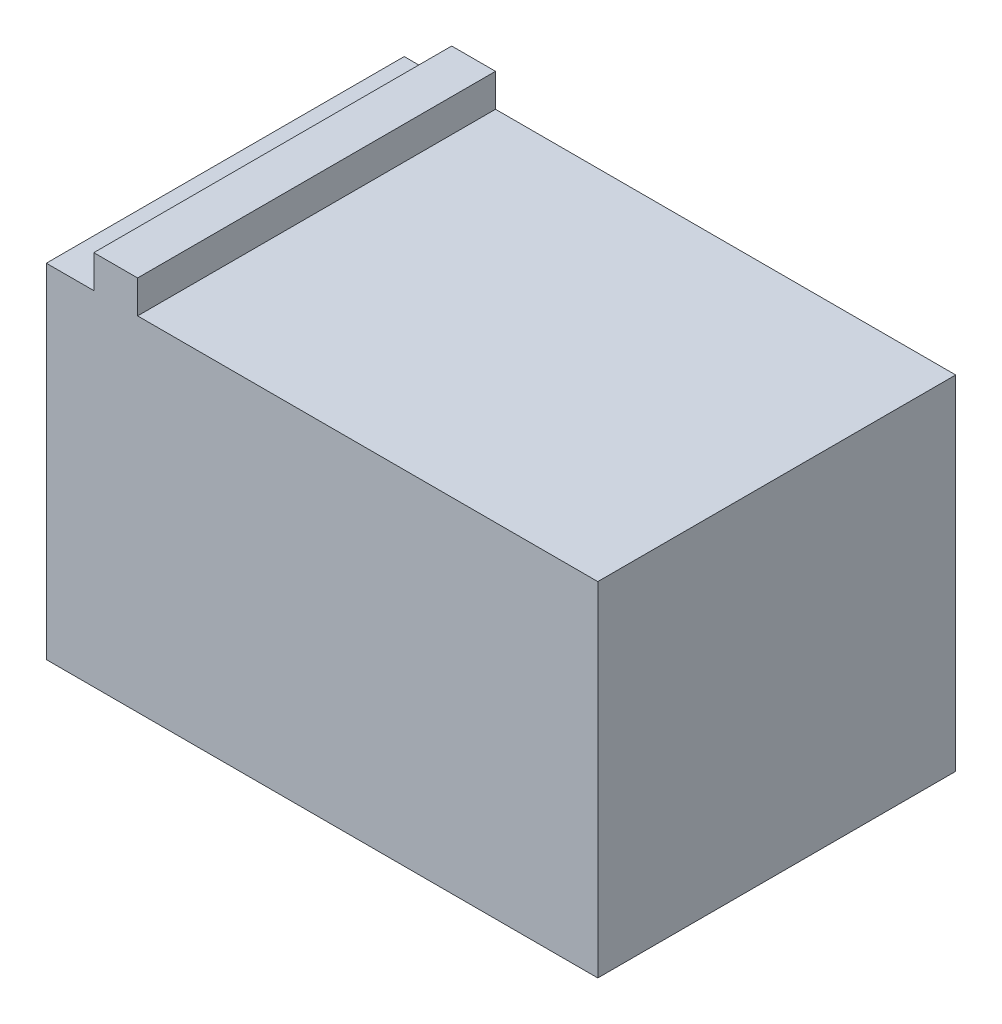
ISO-10303-21;
HEADER;
FILE_DESCRIPTION(('STEP AP214'),'2;1');
FILE_NAME('part.step','',(''),(''),'','','');
FILE_SCHEMA(('AUTOMOTIVE_DESIGN { 1 0 10303 214 1 1 1 1 }'));
ENDSEC;
DATA;
#1=APPLICATION_CONTEXT('core data for automotive mechanical design processes');
#2=APPLICATION_PROTOCOL_DEFINITION('international standard','automotive_design',2000,#1);
#3=PRODUCT_CONTEXT('',#1,'mechanical');
#4=PRODUCT('Part','Part','',(#3));
#5=PRODUCT_RELATED_PRODUCT_CATEGORY('part','',(#4));
#6=PRODUCT_DEFINITION_FORMATION('','',#4);
#7=PRODUCT_DEFINITION_CONTEXT('part definition',#1,'design');
#8=PRODUCT_DEFINITION('design','',#6,#7);
#9=PRODUCT_DEFINITION_SHAPE('','',#8);
#10=(LENGTH_UNIT() NAMED_UNIT(*) SI_UNIT(.MILLI.,.METRE.));
#11=(NAMED_UNIT(*) PLANE_ANGLE_UNIT() SI_UNIT($,.RADIAN.));
#12=(NAMED_UNIT(*) SI_UNIT($,.STERADIAN.) SOLID_ANGLE_UNIT());
#13=UNCERTAINTY_MEASURE_WITH_UNIT(LENGTH_MEASURE(1.E-05),#10,'distance_accuracy_value','');
#14=(GEOMETRIC_REPRESENTATION_CONTEXT(3) GLOBAL_UNCERTAINTY_ASSIGNED_CONTEXT((#13)) GLOBAL_UNIT_ASSIGNED_CONTEXT((#10,
#11,#12)) REPRESENTATION_CONTEXT('',''));
#15=CARTESIAN_POINT('',(0.,0.,0.));
#16=DIRECTION('',(0.,0.,1.));
#17=DIRECTION('',(1.,0.,0.));
#18=AXIS2_PLACEMENT_3D('',#15,#16,#17);
#19=CARTESIAN_POINT('',(0.,94.,0.));
#20=DIRECTION('',(0.,-1.,0.));
#21=DIRECTION('',(0.,0.,-1.));
#22=AXIS2_PLACEMENT_3D('',#19,#20,#21);
#23=PLANE('',#22);
#24=DIRECTION('',(0.,0.,1.));
#25=VECTOR('',#24,1.);
#26=CARTESIAN_POINT('',(-62.5,94.,-49.));
#27=LINE('',#26,#25);
#28=CARTESIAN_POINT('',(-62.5,94.,-49.));
#29=VERTEX_POINT('',#28);
#30=CARTESIAN_POINT('',(-62.5,94.,49.));
#31=VERTEX_POINT('',#30);
#32=EDGE_CURVE('E128',#29,#31,#27,.T.);
#33=ORIENTED_EDGE('',*,*,#32,.F.);
#34=DIRECTION('',(-1.,0.,0.));
#35=VECTOR('',#34,1.);
#36=CARTESIAN_POINT('',(-75.5,94.,-49.));
#37=LINE('',#36,#35);
#38=CARTESIAN_POINT('',(-75.5,94.,-49.));
#39=VERTEX_POINT('',#38);
#40=EDGE_CURVE('E145',#29,#39,#37,.T.);
#41=ORIENTED_EDGE('',*,*,#40,.T.);
#42=DIRECTION('',(0.,0.,1.));
#43=VECTOR('',#42,1.);
#44=CARTESIAN_POINT('',(-75.5,94.,49.));
#45=LINE('',#44,#43);
#46=CARTESIAN_POINT('',(-75.5,94.,49.));
#47=VERTEX_POINT('',#46);
#48=EDGE_CURVE('E150',#39,#47,#45,.T.);
#49=ORIENTED_EDGE('',*,*,#48,.T.);
#50=DIRECTION('',(1.,0.,0.));
#51=VECTOR('',#50,1.);
#52=CARTESIAN_POINT('',(-75.5,94.,49.));
#53=LINE('',#52,#51);
#54=EDGE_CURVE('E63',#47,#31,#53,.T.);
#55=ORIENTED_EDGE('',*,*,#54,.T.);
#56=EDGE_LOOP('',(#33,#41,#49,#55));
#57=FACE_BOUND('',#56,.T.);
#58=ADVANCED_FACE('F39',(#57),#23,.F.);
#59=DIRECTION('',(0.,0.,-1.));
#60=VECTOR('',#59,1.);
#61=CARTESIAN_POINT('',(-50.5,94.,-49.));
#62=LINE('',#61,#60);
#63=CARTESIAN_POINT('',(-50.5,94.,49.));
#64=VERTEX_POINT('',#63);
#65=CARTESIAN_POINT('',(-50.5,94.,-49.));
#66=VERTEX_POINT('',#65);
#67=EDGE_CURVE('E55',#64,#66,#62,.T.);
#68=ORIENTED_EDGE('',*,*,#67,.F.);
#69=CARTESIAN_POINT('',(75.5,94.,49.));
#70=VERTEX_POINT('',#69);
#71=EDGE_CURVE('E153',#64,#70,#53,.T.);
#72=ORIENTED_EDGE('',*,*,#71,.T.);
#73=DIRECTION('',(0.,0.,-1.));
#74=VECTOR('',#73,1.);
#75=CARTESIAN_POINT('',(75.5,94.,49.));
#76=LINE('',#75,#74);
#77=CARTESIAN_POINT('',(75.5,94.,-49.));
#78=VERTEX_POINT('',#77);
#79=EDGE_CURVE('E141',#70,#78,#76,.T.);
#80=ORIENTED_EDGE('',*,*,#79,.T.);
#81=EDGE_CURVE('E147',#78,#66,#37,.T.);
#82=ORIENTED_EDGE('',*,*,#81,.T.);
#83=EDGE_LOOP('',(#68,#72,#80,#82));
#84=FACE_BOUND('',#83,.T.);
#85=ADVANCED_FACE('F188',(#84),#23,.F.);
#86=CARTESIAN_POINT('',(75.5,94.,49.));
#87=DIRECTION('',(-1.,0.,0.));
#88=DIRECTION('',(0.,0.,1.));
#89=AXIS2_PLACEMENT_3D('',#86,#87,#88);
#90=PLANE('',#89);
#91=DIRECTION('',(0.,0.,-1.));
#92=VECTOR('',#91,1.);
#93=CARTESIAN_POINT('',(75.5,0.,49.));
#94=LINE('',#93,#92);
#95=CARTESIAN_POINT('',(75.5,0.,49.));
#96=VERTEX_POINT('',#95);
#97=CARTESIAN_POINT('',(75.5,0.,-49.));
#98=VERTEX_POINT('',#97);
#99=EDGE_CURVE('E130',#96,#98,#94,.T.);
#100=ORIENTED_EDGE('',*,*,#99,.T.);
#101=DIRECTION('',(0.,-1.,0.));
#102=VECTOR('',#101,1.);
#103=CARTESIAN_POINT('',(75.5,94.,-49.));
#104=LINE('',#103,#102);
#105=EDGE_CURVE('E11',#78,#98,#104,.T.);
#106=ORIENTED_EDGE('',*,*,#105,.F.);
#107=ORIENTED_EDGE('',*,*,#79,.F.);
#108=DIRECTION('',(0.,-1.,0.));
#109=VECTOR('',#108,1.);
#110=CARTESIAN_POINT('',(75.5,94.,49.));
#111=LINE('',#110,#109);
#112=EDGE_CURVE('E155',#70,#96,#111,.T.);
#113=ORIENTED_EDGE('',*,*,#112,.T.);
#114=EDGE_LOOP('',(#100,#106,#107,#113));
#115=FACE_BOUND('',#114,.T.);
#116=ADVANCED_FACE('F41',(#115),#90,.F.);
#117=CARTESIAN_POINT('',(-75.5,94.,-49.));
#118=DIRECTION('',(0.,0.,1.));
#119=DIRECTION('',(1.,0.,0.));
#120=AXIS2_PLACEMENT_3D('',#117,#118,#119);
#121=PLANE('',#120);
#122=DIRECTION('',(-1.,0.,0.));
#123=VECTOR('',#122,1.);
#124=CARTESIAN_POINT('',(-75.5,0.,-49.));
#125=LINE('',#124,#123);
#126=CARTESIAN_POINT('',(-75.5,0.,-49.));
#127=VERTEX_POINT('',#126);
#128=EDGE_CURVE('E135',#98,#127,#125,.T.);
#129=ORIENTED_EDGE('',*,*,#128,.T.);
#130=DIRECTION('',(0.,-1.,0.));
#131=VECTOR('',#130,1.);
#132=CARTESIAN_POINT('',(-75.5,94.,-49.));
#133=LINE('',#132,#131);
#134=EDGE_CURVE('E48',#39,#127,#133,.T.);
#135=ORIENTED_EDGE('',*,*,#134,.F.);
#136=ORIENTED_EDGE('',*,*,#40,.F.);
#137=DIRECTION('',(0.,-1.,0.));
#138=VECTOR('',#137,1.);
#139=CARTESIAN_POINT('',(-62.5,103.,-49.));
#140=LINE('',#139,#138);
#141=CARTESIAN_POINT('',(-62.5,103.,-49.));
#142=VERTEX_POINT('',#141);
#143=EDGE_CURVE('E192',#142,#29,#140,.T.);
#144=ORIENTED_EDGE('',*,*,#143,.F.);
#145=DIRECTION('',(-1.,0.,0.));
#146=VECTOR('',#145,1.);
#147=CARTESIAN_POINT('',(-62.5,103.,-49.));
#148=LINE('',#147,#146);
#149=CARTESIAN_POINT('',(-50.5,103.,-49.));
#150=VERTEX_POINT('',#149);
#151=EDGE_CURVE('E121',#150,#142,#148,.T.);
#152=ORIENTED_EDGE('',*,*,#151,.F.);
#153=DIRECTION('',(0.,-1.,0.));
#154=VECTOR('',#153,1.);
#155=CARTESIAN_POINT('',(-50.5,103.,-49.));
#156=LINE('',#155,#154);
#157=EDGE_CURVE('E137',#150,#66,#156,.T.);
#158=ORIENTED_EDGE('',*,*,#157,.T.);
#159=ORIENTED_EDGE('',*,*,#81,.F.);
#160=ORIENTED_EDGE('',*,*,#105,.T.);
#161=EDGE_LOOP('',(#129,#135,#136,#144,#152,#158,#159,#160));
#162=FACE_BOUND('',#161,.T.);
#163=ADVANCED_FACE('F191',(#162),#121,.F.);
#164=CARTESIAN_POINT('',(-75.5,94.,49.));
#165=DIRECTION('',(1.,0.,0.));
#166=DIRECTION('',(0.,0.,-1.));
#167=AXIS2_PLACEMENT_3D('',#164,#165,#166);
#168=PLANE('',#167);
#169=DIRECTION('',(0.,0.,1.));
#170=VECTOR('',#169,1.);
#171=CARTESIAN_POINT('',(-75.5,0.,49.));
#172=LINE('',#171,#170);
#173=CARTESIAN_POINT('',(-75.5,0.,49.));
#174=VERTEX_POINT('',#173);
#175=EDGE_CURVE('E159',#127,#174,#172,.T.);
#176=ORIENTED_EDGE('',*,*,#175,.T.);
#177=DIRECTION('',(0.,-1.,0.));
#178=VECTOR('',#177,1.);
#179=CARTESIAN_POINT('',(-75.5,94.,49.));
#180=LINE('',#179,#178);
#181=EDGE_CURVE('E167',#47,#174,#180,.T.);
#182=ORIENTED_EDGE('',*,*,#181,.F.);
#183=ORIENTED_EDGE('',*,*,#48,.F.);
#184=ORIENTED_EDGE('',*,*,#134,.T.);
#185=EDGE_LOOP('',(#176,#182,#183,#184));
#186=FACE_BOUND('',#185,.T.);
#187=ADVANCED_FACE('F176',(#186),#168,.F.);
#188=CARTESIAN_POINT('',(-75.5,94.,49.));
#189=DIRECTION('',(0.,0.,-1.));
#190=DIRECTION('',(-1.,0.,0.));
#191=AXIS2_PLACEMENT_3D('',#188,#189,#190);
#192=PLANE('',#191);
#193=DIRECTION('',(1.,0.,0.));
#194=VECTOR('',#193,1.);
#195=CARTESIAN_POINT('',(-75.5,0.,49.));
#196=LINE('',#195,#194);
#197=EDGE_CURVE('E146',#174,#96,#196,.T.);
#198=ORIENTED_EDGE('',*,*,#197,.T.);
#199=ORIENTED_EDGE('',*,*,#112,.F.);
#200=ORIENTED_EDGE('',*,*,#71,.F.);
#201=DIRECTION('',(0.,-1.,0.));
#202=VECTOR('',#201,1.);
#203=CARTESIAN_POINT('',(-50.5,103.,49.));
#204=LINE('',#203,#202);
#205=CARTESIAN_POINT('',(-50.5,103.,49.));
#206=VERTEX_POINT('',#205);
#207=EDGE_CURVE('E111',#206,#64,#204,.T.);
#208=ORIENTED_EDGE('',*,*,#207,.F.);
#209=DIRECTION('',(1.,0.,0.));
#210=VECTOR('',#209,1.);
#211=CARTESIAN_POINT('',(-62.5,103.,49.));
#212=LINE('',#211,#210);
#213=CARTESIAN_POINT('',(-62.5,103.,49.));
#214=VERTEX_POINT('',#213);
#215=EDGE_CURVE('E104',#214,#206,#212,.T.);
#216=ORIENTED_EDGE('',*,*,#215,.F.);
#217=DIRECTION('',(0.,-1.,0.));
#218=VECTOR('',#217,1.);
#219=CARTESIAN_POINT('',(-62.5,103.,49.));
#220=LINE('',#219,#218);
#221=EDGE_CURVE('E108',#214,#31,#220,.T.);
#222=ORIENTED_EDGE('',*,*,#221,.T.);
#223=ORIENTED_EDGE('',*,*,#54,.F.);
#224=ORIENTED_EDGE('',*,*,#181,.T.);
#225=EDGE_LOOP('',(#198,#199,#200,#208,#216,#222,#223,#224));
#226=FACE_BOUND('',#225,.T.);
#227=ADVANCED_FACE('F106',(#226),#192,.F.);
#228=CARTESIAN_POINT('',(0.,0.,0.));
#229=DIRECTION('',(0.,-1.,0.));
#230=DIRECTION('',(0.,0.,-1.));
#231=AXIS2_PLACEMENT_3D('',#228,#229,#230);
#232=PLANE('',#231);
#233=ORIENTED_EDGE('',*,*,#99,.F.);
#234=ORIENTED_EDGE('',*,*,#197,.F.);
#235=ORIENTED_EDGE('',*,*,#175,.F.);
#236=ORIENTED_EDGE('',*,*,#128,.F.);
#237=EDGE_LOOP('',(#233,#234,#235,#236));
#238=FACE_BOUND('',#237,.T.);
#239=ADVANCED_FACE('F183',(#238),#232,.T.);
#240=CARTESIAN_POINT('',(-62.5,103.,-49.));
#241=DIRECTION('',(1.,0.,0.));
#242=DIRECTION('',(0.,0.,-1.));
#243=AXIS2_PLACEMENT_3D('',#240,#241,#242);
#244=PLANE('',#243);
#245=ORIENTED_EDGE('',*,*,#32,.T.);
#246=ORIENTED_EDGE('',*,*,#221,.F.);
#247=DIRECTION('',(0.,0.,1.));
#248=VECTOR('',#247,1.);
#249=CARTESIAN_POINT('',(-62.5,103.,-49.));
#250=LINE('',#249,#248);
#251=EDGE_CURVE('E116',#142,#214,#250,.T.);
#252=ORIENTED_EDGE('',*,*,#251,.F.);
#253=ORIENTED_EDGE('',*,*,#143,.T.);
#254=EDGE_LOOP('',(#245,#246,#252,#253));
#255=FACE_BOUND('',#254,.T.);
#256=ADVANCED_FACE('F127',(#255),#244,.F.);
#257=CARTESIAN_POINT('',(-50.5,103.,-49.));
#258=DIRECTION('',(-1.,0.,0.));
#259=DIRECTION('',(0.,0.,1.));
#260=AXIS2_PLACEMENT_3D('',#257,#258,#259);
#261=PLANE('',#260);
#262=ORIENTED_EDGE('',*,*,#67,.T.);
#263=ORIENTED_EDGE('',*,*,#157,.F.);
#264=DIRECTION('',(0.,0.,-1.));
#265=VECTOR('',#264,1.);
#266=CARTESIAN_POINT('',(-50.5,103.,-49.));
#267=LINE('',#266,#265);
#268=EDGE_CURVE('E115',#206,#150,#267,.T.);
#269=ORIENTED_EDGE('',*,*,#268,.F.);
#270=ORIENTED_EDGE('',*,*,#207,.T.);
#271=EDGE_LOOP('',(#262,#263,#269,#270));
#272=FACE_BOUND('',#271,.T.);
#273=ADVANCED_FACE('F207',(#272),#261,.F.);
#274=CARTESIAN_POINT('',(0.,103.,0.));
#275=DIRECTION('',(0.,1.,0.));
#276=DIRECTION('',(0.,0.,1.));
#277=AXIS2_PLACEMENT_3D('',#274,#275,#276);
#278=PLANE('',#277);
#279=ORIENTED_EDGE('',*,*,#251,.T.);
#280=ORIENTED_EDGE('',*,*,#215,.T.);
#281=ORIENTED_EDGE('',*,*,#268,.T.);
#282=ORIENTED_EDGE('',*,*,#151,.T.);
#283=EDGE_LOOP('',(#279,#280,#281,#282));
#284=FACE_BOUND('',#283,.T.);
#285=ADVANCED_FACE('F119',(#284),#278,.T.);
#286=CLOSED_SHELL('',(#58,#85,#116,#163,#187,#227,#239,#256,#273,#285));
#287=MANIFOLD_SOLID_BREP('B2',#286);
#288=ADVANCED_BREP_SHAPE_REPRESENTATION('',(#18,#287),#14);
#289=SHAPE_DEFINITION_REPRESENTATION(#9,#288);
ENDSEC;
END-ISO-10303-21;
